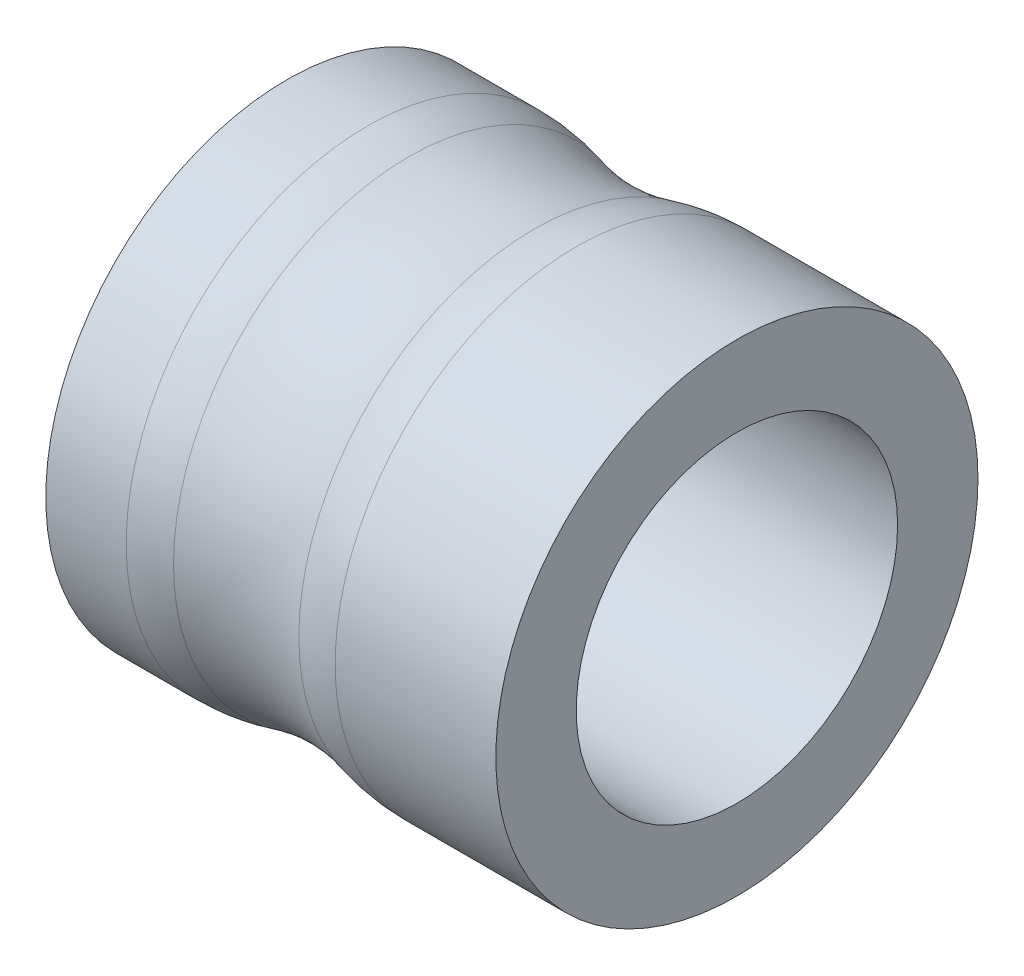
ISO-10303-21;
HEADER;
FILE_DESCRIPTION(('STEP AP214'),'2;1');
FILE_NAME('part.step','',(''),(''),'','','');
FILE_SCHEMA(('AUTOMOTIVE_DESIGN { 1 0 10303 214 1 1 1 1 }'));
ENDSEC;
DATA;
#1=APPLICATION_CONTEXT('core data for automotive mechanical design processes');
#2=APPLICATION_PROTOCOL_DEFINITION('international standard','automotive_design',2000,#1);
#3=PRODUCT_CONTEXT('',#1,'mechanical');
#4=PRODUCT('Part','Part','',(#3));
#5=PRODUCT_RELATED_PRODUCT_CATEGORY('part','',(#4));
#6=PRODUCT_DEFINITION_FORMATION('','',#4);
#7=PRODUCT_DEFINITION_CONTEXT('part definition',#1,'design');
#8=PRODUCT_DEFINITION('design','',#6,#7);
#9=PRODUCT_DEFINITION_SHAPE('','',#8);
#10=(LENGTH_UNIT() NAMED_UNIT(*) SI_UNIT(.MILLI.,.METRE.));
#11=(NAMED_UNIT(*) PLANE_ANGLE_UNIT() SI_UNIT($,.RADIAN.));
#12=(NAMED_UNIT(*) SI_UNIT($,.STERADIAN.) SOLID_ANGLE_UNIT());
#13=UNCERTAINTY_MEASURE_WITH_UNIT(LENGTH_MEASURE(1.E-05),#10,'distance_accuracy_value','');
#14=(GEOMETRIC_REPRESENTATION_CONTEXT(3) GLOBAL_UNCERTAINTY_ASSIGNED_CONTEXT((#13)) GLOBAL_UNIT_ASSIGNED_CONTEXT((#10,
#11,#12)) REPRESENTATION_CONTEXT('',''));
#15=CARTESIAN_POINT('',(0.,0.,0.));
#16=DIRECTION('',(0.,0.,1.));
#17=DIRECTION('',(1.,0.,0.));
#18=AXIS2_PLACEMENT_3D('',#15,#16,#17);
#19=CARTESIAN_POINT('',(0.,1.99999999999999,0.));
#20=DIRECTION('',(-1.,0.,0.));
#21=DIRECTION('',(0.,0.,0.999999999999998));
#22=AXIS2_PLACEMENT_3D('',#19,#20,#21);
#23=PLANE('',#22);
#24=CARTESIAN_POINT('',(0.,0.,0.));
#25=DIRECTION('',(1.,0.,0.));
#26=DIRECTION('',(0.,0.,-0.999999999999998));
#27=AXIS2_PLACEMENT_3D('',#24,#25,#26);
#28=CIRCLE('',#27,2.);
#29=CARTESIAN_POINT('',(0.,0.,-2.));
#30=VERTEX_POINT('',#29);
#31=EDGE_CURVE('E10',#30,#30,#28,.T.);
#32=ORIENTED_EDGE('',*,*,#31,.T.);
#33=EDGE_LOOP('',(#32));
#34=FACE_BOUND('',#33,.T.);
#35=CARTESIAN_POINT('',(0.,0.,0.));
#36=DIRECTION('',(1.,0.,0.));
#37=DIRECTION('',(0.,0.,-0.999999999999998));
#38=AXIS2_PLACEMENT_3D('',#35,#36,#37);
#39=CIRCLE('',#38,3.);
#40=CARTESIAN_POINT('',(0.,0.,-3.));
#41=VERTEX_POINT('',#40);
#42=EDGE_CURVE('E56',#41,#41,#39,.T.);
#43=ORIENTED_EDGE('',*,*,#42,.F.);
#44=EDGE_LOOP('',(#43));
#45=FACE_BOUND('',#44,.T.);
#46=ADVANCED_FACE('F28',(#34,#45),#23,.T.);
#47=CARTESIAN_POINT('',(5.88,0.,0.));
#48=DIRECTION('',(1.,0.,0.));
#49=DIRECTION('',(0.,0.,-0.999999999999998));
#50=AXIS2_PLACEMENT_3D('',#47,#48,#49);
#51=CYLINDRICAL_SURFACE('',#50,2.);
#52=CARTESIAN_POINT('',(5.6,0.,0.));
#53=DIRECTION('',(1.,0.,0.));
#54=DIRECTION('',(0.,0.,-0.999999999999998));
#55=AXIS2_PLACEMENT_3D('',#52,#53,#54);
#56=CIRCLE('',#55,2.);
#57=CARTESIAN_POINT('',(5.6,0.,-2.));
#58=VERTEX_POINT('',#57);
#59=EDGE_CURVE('E34',#58,#58,#56,.T.);
#60=ORIENTED_EDGE('',*,*,#59,.T.);
#61=EDGE_LOOP('',(#60));
#62=FACE_BOUND('',#61,.T.);
#63=ORIENTED_EDGE('',*,*,#31,.F.);
#64=EDGE_LOOP('',(#63));
#65=FACE_BOUND('',#64,.T.);
#66=ADVANCED_FACE('F64',(#62,#65),#51,.F.);
#67=CARTESIAN_POINT('',(5.6,1.99999999999999,0.));
#68=DIRECTION('',(1.,0.,0.));
#69=DIRECTION('',(0.,0.,-0.999999999999998));
#70=AXIS2_PLACEMENT_3D('',#67,#68,#69);
#71=PLANE('',#70);
#72=CARTESIAN_POINT('',(5.6,0.,0.));
#73=DIRECTION('',(1.,0.,0.));
#74=DIRECTION('',(0.,0.,-0.999999999999998));
#75=AXIS2_PLACEMENT_3D('',#72,#73,#74);
#76=CIRCLE('',#75,3.);
#77=CARTESIAN_POINT('',(5.6,0.,-3.));
#78=VERTEX_POINT('',#77);
#79=EDGE_CURVE('E38',#78,#78,#76,.T.);
#80=ORIENTED_EDGE('',*,*,#79,.T.);
#81=EDGE_LOOP('',(#80));
#82=FACE_BOUND('',#81,.T.);
#83=ORIENTED_EDGE('',*,*,#59,.F.);
#84=EDGE_LOOP('',(#83));
#85=FACE_BOUND('',#84,.T.);
#86=ADVANCED_FACE('F68',(#82,#85),#71,.T.);
#87=CARTESIAN_POINT('',(5.88,0.,0.));
#88=DIRECTION('',(1.,0.,0.));
#89=DIRECTION('',(0.,0.,-0.999999999999998));
#90=AXIS2_PLACEMENT_3D('',#87,#88,#89);
#91=CYLINDRICAL_SURFACE('',#90,3.);
#92=CARTESIAN_POINT('',(3.6,0.,0.));
#93=DIRECTION('',(1.,0.,0.));
#94=DIRECTION('',(0.,0.,-0.999999999999998));
#95=AXIS2_PLACEMENT_3D('',#92,#93,#94);
#96=CIRCLE('',#95,3.);
#97=CARTESIAN_POINT('',(3.6,0.,-3.));
#98=VERTEX_POINT('',#97);
#99=EDGE_CURVE('E42',#98,#98,#96,.T.);
#100=ORIENTED_EDGE('',*,*,#99,.T.);
#101=EDGE_LOOP('',(#100));
#102=FACE_BOUND('',#101,.T.);
#103=ORIENTED_EDGE('',*,*,#79,.F.);
#104=EDGE_LOOP('',(#103));
#105=FACE_BOUND('',#104,.T.);
#106=ADVANCED_FACE('F72',(#102,#105),#91,.T.);
#107=CARTESIAN_POINT('',(3.6,0.,0.));
#108=DIRECTION('',(1.,0.,0.));
#109=DIRECTION('',(0.,0.,-0.999999999999998));
#110=AXIS2_PLACEMENT_3D('',#107,#108,#109);
#111=DEGENERATE_TOROIDAL_SURFACE('',#110,1.,2.,.T.);
#112=CARTESIAN_POINT('',(3.08,0.,0.));
#113=DIRECTION('',(1.,0.,0.));
#114=DIRECTION('',(0.,0.,-0.999999999999998));
#115=AXIS2_PLACEMENT_3D('',#112,#113,#114);
#116=CIRCLE('',#115,2.93121723273173);
#117=CARTESIAN_POINT('',(3.08,0.,-2.93121723273173));
#118=VERTEX_POINT('',#117);
#119=EDGE_CURVE('E47',#118,#118,#116,.T.);
#120=ORIENTED_EDGE('',*,*,#119,.T.);
#121=EDGE_LOOP('',(#120));
#122=FACE_BOUND('',#121,.T.);
#123=ORIENTED_EDGE('',*,*,#99,.F.);
#124=EDGE_LOOP('',(#123));
#125=FACE_BOUND('',#124,.T.);
#126=ADVANCED_FACE('F79',(#122,#125),#111,.T.);
#127=CARTESIAN_POINT('',(2.3,0.,0.));
#128=DIRECTION('',(1.,0.,0.));
#129=DIRECTION('',(0.,0.,-0.999999999999998));
#130=AXIS2_PLACEMENT_3D('',#127,#128,#129);
#131=TOROIDAL_SURFACE('',#130,5.82804308182932,3.);
#132=CARTESIAN_POINT('',(1.52000000000001,0.,0.));
#133=DIRECTION('',(1.,0.,0.));
#134=DIRECTION('',(0.,0.,-0.999999999999998));
#135=AXIS2_PLACEMENT_3D('',#132,#133,#134);
#136=CIRCLE('',#135,2.93121723273173);
#137=CARTESIAN_POINT('',(1.52000000000001,0.,-2.93121723273173));
#138=VERTEX_POINT('',#137);
#139=EDGE_CURVE('E50',#138,#138,#136,.T.);
#140=ORIENTED_EDGE('',*,*,#139,.T.);
#141=EDGE_LOOP('',(#140));
#142=FACE_BOUND('',#141,.T.);
#143=ORIENTED_EDGE('',*,*,#119,.F.);
#144=EDGE_LOOP('',(#143));
#145=FACE_BOUND('',#144,.T.);
#146=ADVANCED_FACE('F83',(#142,#145),#131,.F.);
#147=CARTESIAN_POINT('',(1.00000000000001,0.,0.));
#148=DIRECTION('',(1.,0.,0.));
#149=DIRECTION('',(0.,0.,-0.999999999999998));
#150=AXIS2_PLACEMENT_3D('',#147,#148,#149);
#151=DEGENERATE_TOROIDAL_SURFACE('',#150,1.,2.,.T.);
#152=CARTESIAN_POINT('',(1.00000000000001,0.,0.));
#153=DIRECTION('',(1.,0.,0.));
#154=DIRECTION('',(0.,0.,-0.999999999999998));
#155=AXIS2_PLACEMENT_3D('',#152,#153,#154);
#156=CIRCLE('',#155,3.);
#157=CARTESIAN_POINT('',(1.00000000000001,0.,-3.));
#158=VERTEX_POINT('',#157);
#159=EDGE_CURVE('E53',#158,#158,#156,.T.);
#160=ORIENTED_EDGE('',*,*,#159,.T.);
#161=EDGE_LOOP('',(#160));
#162=FACE_BOUND('',#161,.T.);
#163=ORIENTED_EDGE('',*,*,#139,.F.);
#164=EDGE_LOOP('',(#163));
#165=FACE_BOUND('',#164,.T.);
#166=ADVANCED_FACE('F87',(#162,#165),#151,.T.);
#167=CARTESIAN_POINT('',(5.88,0.,0.));
#168=DIRECTION('',(1.,0.,0.));
#169=DIRECTION('',(0.,0.,-0.999999999999998));
#170=AXIS2_PLACEMENT_3D('',#167,#168,#169);
#171=CYLINDRICAL_SURFACE('',#170,3.);
#172=ORIENTED_EDGE('',*,*,#42,.T.);
#173=EDGE_LOOP('',(#172));
#174=FACE_BOUND('',#173,.T.);
#175=ORIENTED_EDGE('',*,*,#159,.F.);
#176=EDGE_LOOP('',(#175));
#177=FACE_BOUND('',#176,.T.);
#178=ADVANCED_FACE('F60',(#174,#177),#171,.T.);
#179=CLOSED_SHELL('',(#46,#66,#86,#106,#126,#146,#166,#178));
#180=MANIFOLD_SOLID_BREP('B2',#179);
#181=ADVANCED_BREP_SHAPE_REPRESENTATION('',(#18,#180),#14);
#182=SHAPE_DEFINITION_REPRESENTATION(#9,#181);
ENDSEC;
END-ISO-10303-21;
